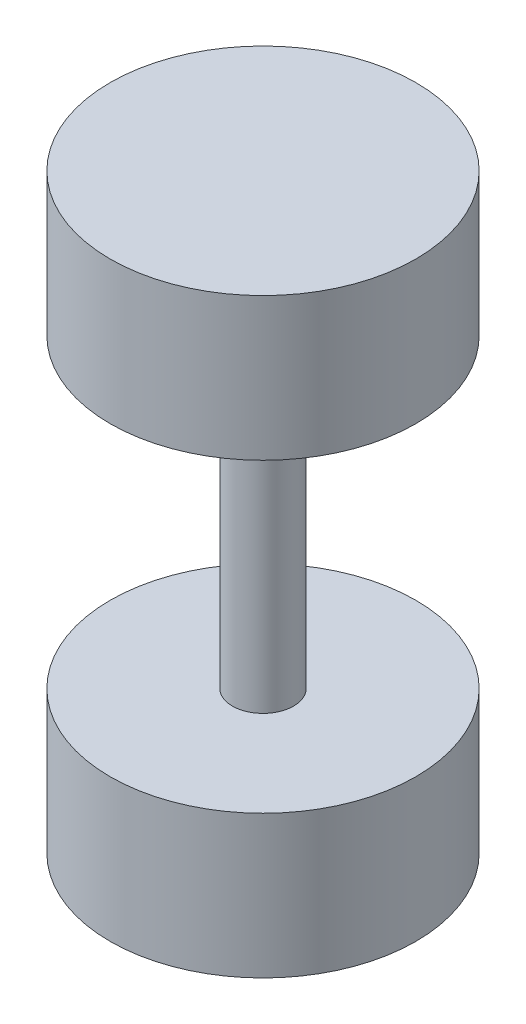
ISO-10303-21;
HEADER;
FILE_DESCRIPTION(('STEP AP214'),'2;1');
FILE_NAME('part.step','',(''),(''),'','','');
FILE_SCHEMA(('AUTOMOTIVE_DESIGN { 1 0 10303 214 1 1 1 1 }'));
ENDSEC;
DATA;
#1=APPLICATION_CONTEXT('core data for automotive mechanical design processes');
#2=APPLICATION_PROTOCOL_DEFINITION('international standard','automotive_design',2000,#1);
#3=PRODUCT_CONTEXT('',#1,'mechanical');
#4=PRODUCT('Part','Part','',(#3));
#5=PRODUCT_RELATED_PRODUCT_CATEGORY('part','',(#4));
#6=PRODUCT_DEFINITION_FORMATION('','',#4);
#7=PRODUCT_DEFINITION_CONTEXT('part definition',#1,'design');
#8=PRODUCT_DEFINITION('design','',#6,#7);
#9=PRODUCT_DEFINITION_SHAPE('','',#8);
#10=(LENGTH_UNIT() NAMED_UNIT(*) SI_UNIT(.MILLI.,.METRE.));
#11=(NAMED_UNIT(*) PLANE_ANGLE_UNIT() SI_UNIT($,.RADIAN.));
#12=(NAMED_UNIT(*) SI_UNIT($,.STERADIAN.) SOLID_ANGLE_UNIT());
#13=UNCERTAINTY_MEASURE_WITH_UNIT(LENGTH_MEASURE(1.E-05),#10,'distance_accuracy_value','');
#14=(GEOMETRIC_REPRESENTATION_CONTEXT(3) GLOBAL_UNCERTAINTY_ASSIGNED_CONTEXT((#13)) GLOBAL_UNIT_ASSIGNED_CONTEXT((#10,
#11,#12)) REPRESENTATION_CONTEXT('',''));
#15=CARTESIAN_POINT('',(0.,0.,0.));
#16=DIRECTION('',(0.,0.,1.));
#17=DIRECTION('',(1.,0.,0.));
#18=AXIS2_PLACEMENT_3D('',#15,#16,#17);
#19=CARTESIAN_POINT('',(0.,7.,0.));
#20=DIRECTION('',(0.,-1.,0.));
#21=DIRECTION('',(0.,0.,-1.));
#22=AXIS2_PLACEMENT_3D('',#19,#20,#21);
#23=CYLINDRICAL_SURFACE('',#22,7.5);
#24=CARTESIAN_POINT('',(0.,7.,0.));
#25=DIRECTION('',(0.,1.,0.));
#26=DIRECTION('',(0.,0.,1.));
#27=AXIS2_PLACEMENT_3D('',#24,#25,#26);
#28=CIRCLE('',#27,7.5);
#29=CARTESIAN_POINT('',(0.,7.,7.5));
#30=VERTEX_POINT('',#29);
#31=EDGE_CURVE('E48',#30,#30,#28,.T.);
#32=ORIENTED_EDGE('',*,*,#31,.F.);
#33=EDGE_LOOP('',(#32));
#34=FACE_BOUND('',#33,.T.);
#35=CARTESIAN_POINT('',(0.,0.,0.));
#36=DIRECTION('',(0.,1.,0.));
#37=DIRECTION('',(0.,0.,1.));
#38=AXIS2_PLACEMENT_3D('',#35,#36,#37);
#39=CIRCLE('',#38,7.5);
#40=CARTESIAN_POINT('',(0.,0.,7.5));
#41=VERTEX_POINT('',#40);
#42=EDGE_CURVE('E42',#41,#41,#39,.T.);
#43=ORIENTED_EDGE('',*,*,#42,.T.);
#44=EDGE_LOOP('',(#43));
#45=FACE_BOUND('',#44,.T.);
#46=ADVANCED_FACE('F39',(#34,#45),#23,.T.);
#47=CARTESIAN_POINT('',(0.,7.,0.));
#48=DIRECTION('',(0.,1.,0.));
#49=DIRECTION('',(0.,0.,1.));
#50=AXIS2_PLACEMENT_3D('',#47,#48,#49);
#51=PLANE('',#50);
#52=CARTESIAN_POINT('',(0.,7.,0.));
#53=DIRECTION('',(0.,1.,0.));
#54=DIRECTION('',(0.,0.,1.));
#55=AXIS2_PLACEMENT_3D('',#52,#53,#54);
#56=CIRCLE('',#55,1.5);
#57=CARTESIAN_POINT('',(0.,7.,1.5));
#58=VERTEX_POINT('',#57);
#59=EDGE_CURVE('E11',#58,#58,#56,.T.);
#60=ORIENTED_EDGE('',*,*,#59,.F.);
#61=EDGE_LOOP('',(#60));
#62=FACE_BOUND('',#61,.T.);
#63=ORIENTED_EDGE('',*,*,#31,.T.);
#64=EDGE_LOOP('',(#63));
#65=FACE_BOUND('',#64,.T.);
#66=ADVANCED_FACE('F148',(#62,#65),#51,.T.);
#67=CARTESIAN_POINT('',(0.,0.,0.));
#68=DIRECTION('',(0.,1.,0.));
#69=DIRECTION('',(0.,0.,1.));
#70=AXIS2_PLACEMENT_3D('',#67,#68,#69);
#71=PLANE('',#70);
#72=DIRECTION('',(-1.,0.,0.));
#73=VECTOR('',#72,1.);
#74=CARTESIAN_POINT('',(-2.5,0.,1.525));
#75=LINE('',#74,#73);
#76=CARTESIAN_POINT('',(2.5,0.,1.525));
#77=VERTEX_POINT('',#76);
#78=CARTESIAN_POINT('',(-2.5,0.,1.525));
#79=VERTEX_POINT('',#78);
#80=EDGE_CURVE('E91',#77,#79,#75,.T.);
#81=ORIENTED_EDGE('',*,*,#80,.F.);
#82=DIRECTION('',(0.,0.,1.));
#83=VECTOR('',#82,1.);
#84=CARTESIAN_POINT('',(2.5,0.,-1.525));
#85=LINE('',#84,#83);
#86=CARTESIAN_POINT('',(2.5,0.,-1.525));
#87=VERTEX_POINT('',#86);
#88=EDGE_CURVE('E56',#87,#77,#85,.T.);
#89=ORIENTED_EDGE('',*,*,#88,.F.);
#90=DIRECTION('',(1.,0.,0.));
#91=VECTOR('',#90,1.);
#92=CARTESIAN_POINT('',(-2.5,0.,-1.525));
#93=LINE('',#92,#91);
#94=CARTESIAN_POINT('',(-2.5,0.,-1.525));
#95=VERTEX_POINT('',#94);
#96=EDGE_CURVE('E111',#95,#87,#93,.T.);
#97=ORIENTED_EDGE('',*,*,#96,.F.);
#98=DIRECTION('',(0.,0.,-1.));
#99=VECTOR('',#98,1.);
#100=CARTESIAN_POINT('',(-2.5,0.,-1.525));
#101=LINE('',#100,#99);
#102=EDGE_CURVE('E122',#79,#95,#101,.T.);
#103=ORIENTED_EDGE('',*,*,#102,.F.);
#104=EDGE_LOOP('',(#81,#89,#97,#103));
#105=FACE_BOUND('',#104,.T.);
#106=ORIENTED_EDGE('',*,*,#42,.F.);
#107=EDGE_LOOP('',(#106));
#108=FACE_BOUND('',#107,.T.);
#109=ADVANCED_FACE('F145',(#105,#108),#71,.F.);
#110=CARTESIAN_POINT('',(0.,22.,0.));
#111=DIRECTION('',(0.,-1.,0.));
#112=DIRECTION('',(0.,0.,-1.));
#113=AXIS2_PLACEMENT_3D('',#110,#111,#112);
#114=CYLINDRICAL_SURFACE('',#113,1.5);
#115=CARTESIAN_POINT('',(0.,22.,0.));
#116=DIRECTION('',(0.,1.,0.));
#117=DIRECTION('',(0.,0.,1.));
#118=AXIS2_PLACEMENT_3D('',#115,#116,#117);
#119=CIRCLE('',#118,1.5);
#120=CARTESIAN_POINT('',(0.,22.,1.5));
#121=VERTEX_POINT('',#120);
#122=EDGE_CURVE('E129',#121,#121,#119,.T.);
#123=ORIENTED_EDGE('',*,*,#122,.F.);
#124=EDGE_LOOP('',(#123));
#125=FACE_BOUND('',#124,.T.);
#126=ORIENTED_EDGE('',*,*,#59,.T.);
#127=EDGE_LOOP('',(#126));
#128=FACE_BOUND('',#127,.T.);
#129=ADVANCED_FACE('F147',(#125,#128),#114,.T.);
#130=CARTESIAN_POINT('',(2.5,6.,-1.525));
#131=DIRECTION('',(1.,0.,0.));
#132=DIRECTION('',(0.,0.,-1.));
#133=AXIS2_PLACEMENT_3D('',#130,#131,#132);
#134=PLANE('',#133);
#135=ORIENTED_EDGE('',*,*,#88,.T.);
#136=DIRECTION('',(0.,-1.,0.));
#137=VECTOR('',#136,1.);
#138=CARTESIAN_POINT('',(2.5,6.,1.525));
#139=LINE('',#138,#137);
#140=CARTESIAN_POINT('',(2.5,6.,1.525));
#141=VERTEX_POINT('',#140);
#142=EDGE_CURVE('E79',#141,#77,#139,.T.);
#143=ORIENTED_EDGE('',*,*,#142,.F.);
#144=DIRECTION('',(0.,0.,1.));
#145=VECTOR('',#144,1.);
#146=CARTESIAN_POINT('',(2.5,6.,-1.525));
#147=LINE('',#146,#145);
#148=CARTESIAN_POINT('',(2.5,6.,-1.525));
#149=VERTEX_POINT('',#148);
#150=EDGE_CURVE('E107',#149,#141,#147,.T.);
#151=ORIENTED_EDGE('',*,*,#150,.F.);
#152=DIRECTION('',(0.,-1.,0.));
#153=VECTOR('',#152,1.);
#154=CARTESIAN_POINT('',(2.5,6.,-1.525));
#155=LINE('',#154,#153);
#156=EDGE_CURVE('E64',#149,#87,#155,.T.);
#157=ORIENTED_EDGE('',*,*,#156,.T.);
#158=EDGE_LOOP('',(#135,#143,#151,#157));
#159=FACE_BOUND('',#158,.T.);
#160=ADVANCED_FACE('F154',(#159),#134,.F.);
#161=CARTESIAN_POINT('',(-2.5,6.,-1.525));
#162=DIRECTION('',(0.,0.,-1.));
#163=DIRECTION('',(-1.,0.,0.));
#164=AXIS2_PLACEMENT_3D('',#161,#162,#163);
#165=PLANE('',#164);
#166=ORIENTED_EDGE('',*,*,#96,.T.);
#167=ORIENTED_EDGE('',*,*,#156,.F.);
#168=DIRECTION('',(1.,0.,0.));
#169=VECTOR('',#168,1.);
#170=CARTESIAN_POINT('',(-2.5,6.,-1.525));
#171=LINE('',#170,#169);
#172=CARTESIAN_POINT('',(-2.5,6.,-1.525));
#173=VERTEX_POINT('',#172);
#174=EDGE_CURVE('E104',#173,#149,#171,.T.);
#175=ORIENTED_EDGE('',*,*,#174,.F.);
#176=DIRECTION('',(0.,-1.,0.));
#177=VECTOR('',#176,1.);
#178=CARTESIAN_POINT('',(-2.5,6.,-1.525));
#179=LINE('',#178,#177);
#180=EDGE_CURVE('E96',#173,#95,#179,.T.);
#181=ORIENTED_EDGE('',*,*,#180,.T.);
#182=EDGE_LOOP('',(#166,#167,#175,#181));
#183=FACE_BOUND('',#182,.T.);
#184=ADVANCED_FACE('F186',(#183),#165,.F.);
#185=CARTESIAN_POINT('',(-2.5,6.,-1.525));
#186=DIRECTION('',(-1.,0.,0.));
#187=DIRECTION('',(0.,0.,1.));
#188=AXIS2_PLACEMENT_3D('',#185,#186,#187);
#189=PLANE('',#188);
#190=ORIENTED_EDGE('',*,*,#102,.T.);
#191=ORIENTED_EDGE('',*,*,#180,.F.);
#192=DIRECTION('',(0.,0.,-1.));
#193=VECTOR('',#192,1.);
#194=CARTESIAN_POINT('',(-2.5,6.,-1.525));
#195=LINE('',#194,#193);
#196=CARTESIAN_POINT('',(-2.5,6.,1.525));
#197=VERTEX_POINT('',#196);
#198=EDGE_CURVE('E99',#197,#173,#195,.T.);
#199=ORIENTED_EDGE('',*,*,#198,.F.);
#200=DIRECTION('',(0.,-1.,0.));
#201=VECTOR('',#200,1.);
#202=CARTESIAN_POINT('',(-2.5,6.,1.525));
#203=LINE('',#202,#201);
#204=EDGE_CURVE('E84',#197,#79,#203,.T.);
#205=ORIENTED_EDGE('',*,*,#204,.T.);
#206=EDGE_LOOP('',(#190,#191,#199,#205));
#207=FACE_BOUND('',#206,.T.);
#208=ADVANCED_FACE('F100',(#207),#189,.F.);
#209=CARTESIAN_POINT('',(-2.5,6.,1.525));
#210=DIRECTION('',(0.,0.,1.));
#211=DIRECTION('',(1.,0.,0.));
#212=AXIS2_PLACEMENT_3D('',#209,#210,#211);
#213=PLANE('',#212);
#214=ORIENTED_EDGE('',*,*,#80,.T.);
#215=ORIENTED_EDGE('',*,*,#204,.F.);
#216=DIRECTION('',(-1.,0.,0.));
#217=VECTOR('',#216,1.);
#218=CARTESIAN_POINT('',(-2.5,6.,1.525));
#219=LINE('',#218,#217);
#220=EDGE_CURVE('E88',#141,#197,#219,.T.);
#221=ORIENTED_EDGE('',*,*,#220,.F.);
#222=ORIENTED_EDGE('',*,*,#142,.T.);
#223=EDGE_LOOP('',(#214,#215,#221,#222));
#224=FACE_BOUND('',#223,.T.);
#225=ADVANCED_FACE('F86',(#224),#213,.F.);
#226=CARTESIAN_POINT('',(0.,6.,0.));
#227=DIRECTION('',(0.,1.,0.));
#228=DIRECTION('',(0.,0.,1.));
#229=AXIS2_PLACEMENT_3D('',#226,#227,#228);
#230=PLANE('',#229);
#231=ORIENTED_EDGE('',*,*,#150,.T.);
#232=ORIENTED_EDGE('',*,*,#220,.T.);
#233=ORIENTED_EDGE('',*,*,#198,.T.);
#234=ORIENTED_EDGE('',*,*,#174,.T.);
#235=EDGE_LOOP('',(#231,#232,#233,#234));
#236=FACE_BOUND('',#235,.T.);
#237=ADVANCED_FACE('F106',(#236),#230,.F.);
#238=CARTESIAN_POINT('',(0.,29.,0.));
#239=DIRECTION('',(0.,-1.,0.));
#240=DIRECTION('',(0.,0.,-1.));
#241=AXIS2_PLACEMENT_3D('',#238,#239,#240);
#242=CYLINDRICAL_SURFACE('',#241,7.5);
#243=CARTESIAN_POINT('',(0.,29.,0.));
#244=DIRECTION('',(0.,1.,0.));
#245=DIRECTION('',(0.,0.,1.));
#246=AXIS2_PLACEMENT_3D('',#243,#244,#245);
#247=CIRCLE('',#246,7.5);
#248=CARTESIAN_POINT('',(0.,29.,7.5));
#249=VERTEX_POINT('',#248);
#250=EDGE_CURVE('E119',#249,#249,#247,.T.);
#251=ORIENTED_EDGE('',*,*,#250,.F.);
#252=EDGE_LOOP('',(#251));
#253=FACE_BOUND('',#252,.T.);
#254=CARTESIAN_POINT('',(0.,22.,0.));
#255=DIRECTION('',(0.,1.,0.));
#256=DIRECTION('',(0.,0.,1.));
#257=AXIS2_PLACEMENT_3D('',#254,#255,#256);
#258=CIRCLE('',#257,7.5);
#259=CARTESIAN_POINT('',(0.,22.,7.5));
#260=VERTEX_POINT('',#259);
#261=EDGE_CURVE('E256',#260,#260,#258,.T.);
#262=ORIENTED_EDGE('',*,*,#261,.T.);
#263=EDGE_LOOP('',(#262));
#264=FACE_BOUND('',#263,.T.);
#265=ADVANCED_FACE('F219',(#253,#264),#242,.T.);
#266=CARTESIAN_POINT('',(0.,29.,0.));
#267=DIRECTION('',(0.,1.,0.));
#268=DIRECTION('',(0.,0.,1.));
#269=AXIS2_PLACEMENT_3D('',#266,#267,#268);
#270=PLANE('',#269);
#271=ORIENTED_EDGE('',*,*,#250,.T.);
#272=EDGE_LOOP('',(#271));
#273=FACE_BOUND('',#272,.T.);
#274=ADVANCED_FACE('F228',(#273),#270,.T.);
#275=CARTESIAN_POINT('',(0.,22.,0.));
#276=DIRECTION('',(0.,1.,0.));
#277=DIRECTION('',(0.,0.,1.));
#278=AXIS2_PLACEMENT_3D('',#275,#276,#277);
#279=PLANE('',#278);
#280=ORIENTED_EDGE('',*,*,#122,.T.);
#281=EDGE_LOOP('',(#280));
#282=FACE_BOUND('',#281,.T.);
#283=ORIENTED_EDGE('',*,*,#261,.F.);
#284=EDGE_LOOP('',(#283));
#285=FACE_BOUND('',#284,.T.);
#286=ADVANCED_FACE('F238',(#282,#285),#279,.F.);
#287=CLOSED_SHELL('',(#46,#66,#109,#129,#160,#184,#208,#225,#237,#265,#274,#286));
#288=MANIFOLD_SOLID_BREP('B2',#287);
#289=ADVANCED_BREP_SHAPE_REPRESENTATION('',(#18,#288),#14);
#290=SHAPE_DEFINITION_REPRESENTATION(#9,#289);
ENDSEC;
END-ISO-10303-21;
